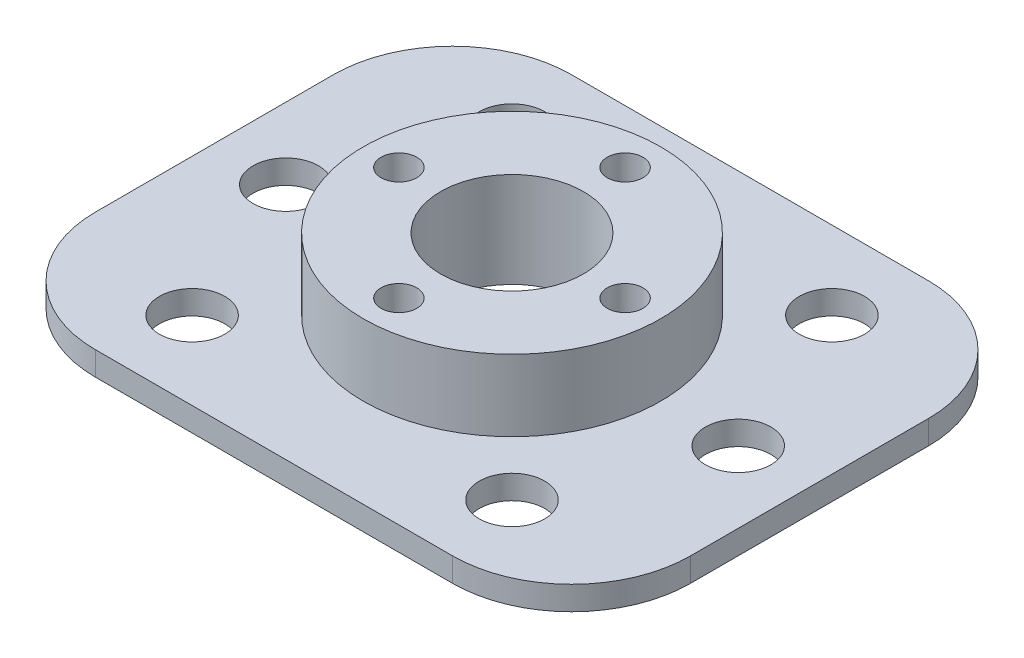
ISO-10303-21;
HEADER;
FILE_DESCRIPTION(('STEP AP214'),'2;1');
FILE_NAME('part.step','',(''),(''),'','','');
FILE_SCHEMA(('AUTOMOTIVE_DESIGN { 1 0 10303 214 1 1 1 1 }'));
ENDSEC;
DATA;
#1=APPLICATION_CONTEXT('core data for automotive mechanical design processes');
#2=APPLICATION_PROTOCOL_DEFINITION('international standard','automotive_design',2000,#1);
#3=PRODUCT_CONTEXT('',#1,'mechanical');
#4=PRODUCT('Part','Part','',(#3));
#5=PRODUCT_RELATED_PRODUCT_CATEGORY('part','',(#4));
#6=PRODUCT_DEFINITION_FORMATION('','',#4);
#7=PRODUCT_DEFINITION_CONTEXT('part definition',#1,'design');
#8=PRODUCT_DEFINITION('design','',#6,#7);
#9=PRODUCT_DEFINITION_SHAPE('','',#8);
#10=(LENGTH_UNIT() NAMED_UNIT(*) SI_UNIT(.MILLI.,.METRE.));
#11=(NAMED_UNIT(*) PLANE_ANGLE_UNIT() SI_UNIT($,.RADIAN.));
#12=(NAMED_UNIT(*) SI_UNIT($,.STERADIAN.) SOLID_ANGLE_UNIT());
#13=UNCERTAINTY_MEASURE_WITH_UNIT(LENGTH_MEASURE(1.E-05),#10,'distance_accuracy_value','');
#14=(GEOMETRIC_REPRESENTATION_CONTEXT(3) GLOBAL_UNCERTAINTY_ASSIGNED_CONTEXT((#13)) GLOBAL_UNIT_ASSIGNED_CONTEXT((#10,
#11,#12)) REPRESENTATION_CONTEXT('',''));
#15=CARTESIAN_POINT('',(0.,0.,0.));
#16=DIRECTION('',(0.,0.,1.));
#17=DIRECTION('',(1.,0.,0.));
#18=AXIS2_PLACEMENT_3D('',#15,#16,#17);
#19=CARTESIAN_POINT('',(25.,2.,0.));
#20=DIRECTION('',(1.,0.,0.));
#21=DIRECTION('',(0.,0.,-1.));
#22=AXIS2_PLACEMENT_3D('',#19,#20,#21);
#23=PLANE('',#22);
#24=DIRECTION('',(0.,0.,1.));
#25=VECTOR('',#24,1.);
#26=CARTESIAN_POINT('',(25.,0.,0.));
#27=LINE('',#26,#25);
#28=CARTESIAN_POINT('',(25.,0.,-10.));
#29=VERTEX_POINT('',#28);
#30=CARTESIAN_POINT('',(25.,0.,10.));
#31=VERTEX_POINT('',#30);
#32=EDGE_CURVE('E128',#29,#31,#27,.T.);
#33=ORIENTED_EDGE('',*,*,#32,.F.);
#34=DIRECTION('',(0.,-1.,0.));
#35=VECTOR('',#34,1.);
#36=CARTESIAN_POINT('',(25.,2.,-10.));
#37=LINE('',#36,#35);
#38=CARTESIAN_POINT('',(25.,2.,-10.));
#39=VERTEX_POINT('',#38);
#40=EDGE_CURVE('E156',#29,#39,#37,.F.);
#41=ORIENTED_EDGE('',*,*,#40,.T.);
#42=DIRECTION('',(0.,0.,1.));
#43=VECTOR('',#42,1.);
#44=CARTESIAN_POINT('',(25.,2.,0.));
#45=LINE('',#44,#43);
#46=CARTESIAN_POINT('',(25.,2.,10.));
#47=VERTEX_POINT('',#46);
#48=EDGE_CURVE('E183',#39,#47,#45,.T.);
#49=ORIENTED_EDGE('',*,*,#48,.T.);
#50=DIRECTION('',(0.,-1.,0.));
#51=VECTOR('',#50,1.);
#52=CARTESIAN_POINT('',(25.,0.,10.));
#53=LINE('',#52,#51);
#54=EDGE_CURVE('E152',#47,#31,#53,.T.);
#55=ORIENTED_EDGE('',*,*,#54,.T.);
#56=EDGE_LOOP('',(#33,#41,#49,#55));
#57=FACE_BOUND('',#56,.T.);
#58=ADVANCED_FACE('F38',(#57),#23,.T.);
#59=CARTESIAN_POINT('',(0.,2.,-20.));
#60=DIRECTION('',(0.,0.,-1.));
#61=DIRECTION('',(-1.,0.,0.));
#62=AXIS2_PLACEMENT_3D('',#59,#60,#61);
#63=PLANE('',#62);
#64=DIRECTION('',(1.,0.,0.));
#65=VECTOR('',#64,1.);
#66=CARTESIAN_POINT('',(0.,2.,-20.));
#67=LINE('',#66,#65);
#68=CARTESIAN_POINT('',(-15.,2.,-20.));
#69=VERTEX_POINT('',#68);
#70=CARTESIAN_POINT('',(15.,2.,-20.));
#71=VERTEX_POINT('',#70);
#72=EDGE_CURVE('E180',#69,#71,#67,.T.);
#73=ORIENTED_EDGE('',*,*,#72,.T.);
#74=DIRECTION('',(0.,-1.,0.));
#75=VECTOR('',#74,1.);
#76=CARTESIAN_POINT('',(15.,2.,-20.));
#77=LINE('',#76,#75);
#78=CARTESIAN_POINT('',(15.,0.,-20.));
#79=VERTEX_POINT('',#78);
#80=EDGE_CURVE('E118',#71,#79,#77,.T.);
#81=ORIENTED_EDGE('',*,*,#80,.T.);
#82=DIRECTION('',(1.,0.,0.));
#83=VECTOR('',#82,1.);
#84=CARTESIAN_POINT('',(0.,0.,-20.));
#85=LINE('',#84,#83);
#86=CARTESIAN_POINT('',(-15.,0.,-20.));
#87=VERTEX_POINT('',#86);
#88=EDGE_CURVE('E109',#87,#79,#85,.T.);
#89=ORIENTED_EDGE('',*,*,#88,.F.);
#90=DIRECTION('',(0.,-1.,0.));
#91=VECTOR('',#90,1.);
#92=CARTESIAN_POINT('',(-15.,2.,-20.));
#93=LINE('',#92,#91);
#94=EDGE_CURVE('E124',#87,#69,#93,.F.);
#95=ORIENTED_EDGE('',*,*,#94,.T.);
#96=EDGE_LOOP('',(#73,#81,#89,#95));
#97=FACE_BOUND('',#96,.T.);
#98=ADVANCED_FACE('F123',(#97),#63,.T.);
#99=CARTESIAN_POINT('',(-25.,2.,0.));
#100=DIRECTION('',(1.,0.,0.));
#101=DIRECTION('',(0.,0.,-1.));
#102=AXIS2_PLACEMENT_3D('',#99,#100,#101);
#103=PLANE('',#102);
#104=DIRECTION('',(0.,0.,1.));
#105=VECTOR('',#104,1.);
#106=CARTESIAN_POINT('',(-25.,0.,0.));
#107=LINE('',#106,#105);
#108=CARTESIAN_POINT('',(-25.,0.,-10.));
#109=VERTEX_POINT('',#108);
#110=CARTESIAN_POINT('',(-25.,0.,10.));
#111=VERTEX_POINT('',#110);
#112=EDGE_CURVE('E111',#109,#111,#107,.T.);
#113=ORIENTED_EDGE('',*,*,#112,.T.);
#114=DIRECTION('',(0.,-1.,0.));
#115=VECTOR('',#114,1.);
#116=CARTESIAN_POINT('',(-25.,2.,10.));
#117=LINE('',#116,#115);
#118=CARTESIAN_POINT('',(-25.,2.,10.));
#119=VERTEX_POINT('',#118);
#120=EDGE_CURVE('E11',#111,#119,#117,.F.);
#121=ORIENTED_EDGE('',*,*,#120,.T.);
#122=DIRECTION('',(0.,0.,1.));
#123=VECTOR('',#122,1.);
#124=CARTESIAN_POINT('',(-25.,2.,0.));
#125=LINE('',#124,#123);
#126=CARTESIAN_POINT('',(-25.,2.,-10.));
#127=VERTEX_POINT('',#126);
#128=EDGE_CURVE('E138',#127,#119,#125,.T.);
#129=ORIENTED_EDGE('',*,*,#128,.F.);
#130=DIRECTION('',(0.,-1.,0.));
#131=VECTOR('',#130,1.);
#132=CARTESIAN_POINT('',(-25.,0.,-10.));
#133=LINE('',#132,#131);
#134=EDGE_CURVE('E47',#127,#109,#133,.T.);
#135=ORIENTED_EDGE('',*,*,#134,.T.);
#136=EDGE_LOOP('',(#113,#121,#129,#135));
#137=FACE_BOUND('',#136,.T.);
#138=ADVANCED_FACE('F177',(#137),#103,.F.);
#139=CARTESIAN_POINT('',(0.,2.,20.));
#140=DIRECTION('',(0.,0.,-1.));
#141=DIRECTION('',(-1.,0.,0.));
#142=AXIS2_PLACEMENT_3D('',#139,#140,#141);
#143=PLANE('',#142);
#144=DIRECTION('',(1.,0.,0.));
#145=VECTOR('',#144,1.);
#146=CARTESIAN_POINT('',(0.,2.,20.));
#147=LINE('',#146,#145);
#148=CARTESIAN_POINT('',(-15.,2.,20.));
#149=VERTEX_POINT('',#148);
#150=CARTESIAN_POINT('',(15.,2.,20.));
#151=VERTEX_POINT('',#150);
#152=EDGE_CURVE('E133',#149,#151,#147,.T.);
#153=ORIENTED_EDGE('',*,*,#152,.F.);
#154=DIRECTION('',(0.,-1.,0.));
#155=VECTOR('',#154,1.);
#156=CARTESIAN_POINT('',(-15.,2.,20.));
#157=LINE('',#156,#155);
#158=CARTESIAN_POINT('',(-15.,0.,20.));
#159=VERTEX_POINT('',#158);
#160=EDGE_CURVE('E171',#149,#159,#157,.T.);
#161=ORIENTED_EDGE('',*,*,#160,.T.);
#162=DIRECTION('',(1.,0.,0.));
#163=VECTOR('',#162,1.);
#164=CARTESIAN_POINT('',(0.,0.,20.));
#165=LINE('',#164,#163);
#166=CARTESIAN_POINT('',(15.,0.,20.));
#167=VERTEX_POINT('',#166);
#168=EDGE_CURVE('E216',#159,#167,#165,.T.);
#169=ORIENTED_EDGE('',*,*,#168,.T.);
#170=DIRECTION('',(0.,-1.,0.));
#171=VECTOR('',#170,1.);
#172=CARTESIAN_POINT('',(15.,2.,20.));
#173=LINE('',#172,#171);
#174=EDGE_CURVE('E54',#167,#151,#173,.F.);
#175=ORIENTED_EDGE('',*,*,#174,.T.);
#176=EDGE_LOOP('',(#153,#161,#169,#175));
#177=FACE_BOUND('',#176,.T.);
#178=ADVANCED_FACE('F295',(#177),#143,.F.);
#179=CARTESIAN_POINT('',(13.4350288425443,2.,13.4350288425445));
#180=DIRECTION('',(0.,-1.,0.));
#181=DIRECTION('',(0.,0.,-1.));
#182=AXIS2_PLACEMENT_3D('',#179,#180,#181);
#183=CYLINDRICAL_SURFACE('',#182,2.74999999999997);
#184=CARTESIAN_POINT('',(13.4350288425443,2.,13.4350288425445));
#185=DIRECTION('',(0.,1.,0.));
#186=DIRECTION('',(0.,0.,1.));
#187=AXIS2_PLACEMENT_3D('',#184,#185,#186);
#188=CIRCLE('',#187,2.74999999999997);
#189=CARTESIAN_POINT('',(13.4350288425443,2.,16.1850288425445));
#190=VERTEX_POINT('',#189);
#191=EDGE_CURVE('E247',#190,#190,#188,.T.);
#192=ORIENTED_EDGE('',*,*,#191,.T.);
#193=EDGE_LOOP('',(#192));
#194=FACE_BOUND('',#193,.T.);
#195=CARTESIAN_POINT('',(13.4350288425443,0.,13.4350288425445));
#196=DIRECTION('',(0.,1.,0.));
#197=DIRECTION('',(0.,0.,1.));
#198=AXIS2_PLACEMENT_3D('',#195,#196,#197);
#199=CIRCLE('',#198,2.74999999999997);
#200=CARTESIAN_POINT('',(13.4350288425443,0.,16.1850288425445));
#201=VERTEX_POINT('',#200);
#202=EDGE_CURVE('E208',#201,#201,#199,.T.);
#203=ORIENTED_EDGE('',*,*,#202,.F.);
#204=EDGE_LOOP('',(#203));
#205=FACE_BOUND('',#204,.T.);
#206=ADVANCED_FACE('F291',(#194,#205),#183,.F.);
#207=CARTESIAN_POINT('',(19.0000000000001,2.,0.));
#208=DIRECTION('',(0.,-1.,0.));
#209=DIRECTION('',(0.,0.,-1.));
#210=AXIS2_PLACEMENT_3D('',#207,#208,#209);
#211=CYLINDRICAL_SURFACE('',#210,2.75000000000015);
#212=CARTESIAN_POINT('',(19.0000000000001,2.,0.));
#213=DIRECTION('',(0.,1.,0.));
#214=DIRECTION('',(0.,0.,1.));
#215=AXIS2_PLACEMENT_3D('',#212,#213,#214);
#216=CIRCLE('',#215,2.75000000000015);
#217=CARTESIAN_POINT('',(19.0000000000001,2.,2.75000000000015));
#218=VERTEX_POINT('',#217);
#219=EDGE_CURVE('E243',#218,#218,#216,.T.);
#220=ORIENTED_EDGE('',*,*,#219,.T.);
#221=EDGE_LOOP('',(#220));
#222=FACE_BOUND('',#221,.T.);
#223=CARTESIAN_POINT('',(19.0000000000001,0.,0.));
#224=DIRECTION('',(0.,1.,0.));
#225=DIRECTION('',(0.,0.,1.));
#226=AXIS2_PLACEMENT_3D('',#223,#224,#225);
#227=CIRCLE('',#226,2.75000000000015);
#228=CARTESIAN_POINT('',(19.0000000000001,0.,2.75000000000015));
#229=VERTEX_POINT('',#228);
#230=EDGE_CURVE('E204',#229,#229,#227,.T.);
#231=ORIENTED_EDGE('',*,*,#230,.F.);
#232=EDGE_LOOP('',(#231));
#233=FACE_BOUND('',#232,.T.);
#234=ADVANCED_FACE('F294',(#222,#233),#211,.F.);
#235=CARTESIAN_POINT('',(13.4350288425443,2.,-13.4350288425444));
#236=DIRECTION('',(0.,-1.,0.));
#237=DIRECTION('',(0.,0.,-1.));
#238=AXIS2_PLACEMENT_3D('',#235,#236,#237);
#239=CYLINDRICAL_SURFACE('',#238,2.75);
#240=CARTESIAN_POINT('',(13.4350288425443,2.,-13.4350288425444));
#241=DIRECTION('',(0.,1.,0.));
#242=DIRECTION('',(0.,0.,1.));
#243=AXIS2_PLACEMENT_3D('',#240,#241,#242);
#244=CIRCLE('',#243,2.75);
#245=CARTESIAN_POINT('',(13.4350288425443,2.,-10.6850288425444));
#246=VERTEX_POINT('',#245);
#247=EDGE_CURVE('E239',#246,#246,#244,.T.);
#248=ORIENTED_EDGE('',*,*,#247,.T.);
#249=EDGE_LOOP('',(#248));
#250=FACE_BOUND('',#249,.T.);
#251=CARTESIAN_POINT('',(13.4350288425443,0.,-13.4350288425444));
#252=DIRECTION('',(0.,1.,0.));
#253=DIRECTION('',(0.,0.,1.));
#254=AXIS2_PLACEMENT_3D('',#251,#252,#253);
#255=CIRCLE('',#254,2.75);
#256=CARTESIAN_POINT('',(13.4350288425443,0.,-10.6850288425444));
#257=VERTEX_POINT('',#256);
#258=EDGE_CURVE('E200',#257,#257,#255,.T.);
#259=ORIENTED_EDGE('',*,*,#258,.F.);
#260=EDGE_LOOP('',(#259));
#261=FACE_BOUND('',#260,.T.);
#262=ADVANCED_FACE('F299',(#250,#261),#239,.F.);
#263=CARTESIAN_POINT('',(-13.4350288425445,2.,-13.4350288425444));
#264=DIRECTION('',(0.,-1.,0.));
#265=DIRECTION('',(0.,0.,-1.));
#266=AXIS2_PLACEMENT_3D('',#263,#264,#265);
#267=CYLINDRICAL_SURFACE('',#266,2.75);
#268=CARTESIAN_POINT('',(-13.4350288425445,2.,-13.4350288425444));
#269=DIRECTION('',(0.,1.,0.));
#270=DIRECTION('',(0.,0.,1.));
#271=AXIS2_PLACEMENT_3D('',#268,#269,#270);
#272=CIRCLE('',#271,2.75);
#273=CARTESIAN_POINT('',(-13.4350288425445,2.,-10.6850288425444));
#274=VERTEX_POINT('',#273);
#275=EDGE_CURVE('E231',#274,#274,#272,.T.);
#276=ORIENTED_EDGE('',*,*,#275,.T.);
#277=EDGE_LOOP('',(#276));
#278=FACE_BOUND('',#277,.T.);
#279=CARTESIAN_POINT('',(-13.4350288425445,0.,-13.4350288425444));
#280=DIRECTION('',(0.,1.,0.));
#281=DIRECTION('',(0.,0.,1.));
#282=AXIS2_PLACEMENT_3D('',#279,#280,#281);
#283=CIRCLE('',#282,2.75);
#284=CARTESIAN_POINT('',(-13.4350288425445,0.,-10.6850288425444));
#285=VERTEX_POINT('',#284);
#286=EDGE_CURVE('E196',#285,#285,#283,.T.);
#287=ORIENTED_EDGE('',*,*,#286,.F.);
#288=EDGE_LOOP('',(#287));
#289=FACE_BOUND('',#288,.T.);
#290=ADVANCED_FACE('F303',(#278,#289),#267,.F.);
#291=CARTESIAN_POINT('',(-19.0000000000001,2.,0.));
#292=DIRECTION('',(0.,-1.,0.));
#293=DIRECTION('',(0.,0.,-1.));
#294=AXIS2_PLACEMENT_3D('',#291,#292,#293);
#295=CYLINDRICAL_SURFACE('',#294,2.75000000000002);
#296=CARTESIAN_POINT('',(-19.0000000000001,2.,0.));
#297=DIRECTION('',(0.,1.,0.));
#298=DIRECTION('',(0.,0.,1.));
#299=AXIS2_PLACEMENT_3D('',#296,#297,#298);
#300=CIRCLE('',#299,2.75000000000002);
#301=CARTESIAN_POINT('',(-19.0000000000001,2.,2.75000000000002));
#302=VERTEX_POINT('',#301);
#303=EDGE_CURVE('E225',#302,#302,#300,.T.);
#304=ORIENTED_EDGE('',*,*,#303,.T.);
#305=EDGE_LOOP('',(#304));
#306=FACE_BOUND('',#305,.T.);
#307=CARTESIAN_POINT('',(-19.0000000000001,0.,0.));
#308=DIRECTION('',(0.,1.,0.));
#309=DIRECTION('',(0.,0.,1.));
#310=AXIS2_PLACEMENT_3D('',#307,#308,#309);
#311=CIRCLE('',#310,2.75000000000002);
#312=CARTESIAN_POINT('',(-19.0000000000001,0.,2.75000000000002));
#313=VERTEX_POINT('',#312);
#314=EDGE_CURVE('E191',#313,#313,#311,.T.);
#315=ORIENTED_EDGE('',*,*,#314,.F.);
#316=EDGE_LOOP('',(#315));
#317=FACE_BOUND('',#316,.T.);
#318=ADVANCED_FACE('F307',(#306,#317),#295,.F.);
#319=CARTESIAN_POINT('',(-13.4350288425445,2.,13.4350288425445));
#320=DIRECTION('',(0.,-1.,0.));
#321=DIRECTION('',(0.,0.,-1.));
#322=AXIS2_PLACEMENT_3D('',#319,#320,#321);
#323=CYLINDRICAL_SURFACE('',#322,2.74999999999999);
#324=CARTESIAN_POINT('',(-13.4350288425445,2.,13.4350288425445));
#325=DIRECTION('',(0.,1.,0.));
#326=DIRECTION('',(0.,0.,1.));
#327=AXIS2_PLACEMENT_3D('',#324,#325,#326);
#328=CIRCLE('',#327,2.74999999999999);
#329=CARTESIAN_POINT('',(-13.4350288425445,2.,16.1850288425445));
#330=VERTEX_POINT('',#329);
#331=EDGE_CURVE('E221',#330,#330,#328,.T.);
#332=ORIENTED_EDGE('',*,*,#331,.T.);
#333=EDGE_LOOP('',(#332));
#334=FACE_BOUND('',#333,.T.);
#335=CARTESIAN_POINT('',(-13.4350288425445,0.,13.4350288425445));
#336=DIRECTION('',(0.,1.,0.));
#337=DIRECTION('',(0.,0.,1.));
#338=AXIS2_PLACEMENT_3D('',#335,#336,#337);
#339=CIRCLE('',#338,2.74999999999999);
#340=CARTESIAN_POINT('',(-13.4350288425445,0.,16.1850288425445));
#341=VERTEX_POINT('',#340);
#342=EDGE_CURVE('E187',#341,#341,#339,.T.);
#343=ORIENTED_EDGE('',*,*,#342,.F.);
#344=EDGE_LOOP('',(#343));
#345=FACE_BOUND('',#344,.T.);
#346=ADVANCED_FACE('F276',(#334,#345),#323,.F.);
#347=CARTESIAN_POINT('',(0.,2.,0.));
#348=DIRECTION('',(0.,-1.,0.));
#349=DIRECTION('',(0.,0.,-1.));
#350=AXIS2_PLACEMENT_3D('',#347,#348,#349);
#351=CYLINDRICAL_SURFACE('',#350,6.);
#352=CARTESIAN_POINT('',(0.,0.,0.));
#353=DIRECTION('',(0.,1.,0.));
#354=DIRECTION('',(0.,0.,1.));
#355=AXIS2_PLACEMENT_3D('',#352,#353,#354);
#356=CIRCLE('',#355,6.);
#357=CARTESIAN_POINT('',(0.,0.,6.));
#358=VERTEX_POINT('',#357);
#359=EDGE_CURVE('E141',#358,#358,#356,.T.);
#360=ORIENTED_EDGE('',*,*,#359,.F.);
#361=EDGE_LOOP('',(#360));
#362=FACE_BOUND('',#361,.T.);
#363=CARTESIAN_POINT('',(0.,8.,0.));
#364=DIRECTION('',(0.,1.,0.));
#365=DIRECTION('',(0.,0.,1.));
#366=AXIS2_PLACEMENT_3D('',#363,#364,#365);
#367=CIRCLE('',#366,6.);
#368=CARTESIAN_POINT('',(0.,8.,6.));
#369=VERTEX_POINT('',#368);
#370=EDGE_CURVE('E524',#369,#369,#367,.T.);
#371=ORIENTED_EDGE('',*,*,#370,.T.);
#372=EDGE_LOOP('',(#371));
#373=FACE_BOUND('',#372,.T.);
#374=ADVANCED_FACE('F265',(#362,#373),#351,.F.);
#375=CARTESIAN_POINT('',(0.,2.,0.));
#376=DIRECTION('',(0.,1.,0.));
#377=DIRECTION('',(0.,0.,1.));
#378=AXIS2_PLACEMENT_3D('',#375,#376,#377);
#379=PLANE('',#378);
#380=CARTESIAN_POINT('',(0.,2.,0.));
#381=DIRECTION('',(0.,1.,0.));
#382=DIRECTION('',(0.,0.,1.));
#383=AXIS2_PLACEMENT_3D('',#380,#381,#382);
#384=CIRCLE('',#383,12.5);
#385=CARTESIAN_POINT('',(0.,2.,12.5));
#386=VERTEX_POINT('',#385);
#387=EDGE_CURVE('E192',#386,#386,#384,.F.);
#388=ORIENTED_EDGE('',*,*,#387,.T.);
#389=EDGE_LOOP('',(#388));
#390=FACE_BOUND('',#389,.T.);
#391=ORIENTED_EDGE('',*,*,#331,.F.);
#392=EDGE_LOOP('',(#391));
#393=FACE_BOUND('',#392,.T.);
#394=ORIENTED_EDGE('',*,*,#303,.F.);
#395=EDGE_LOOP('',(#394));
#396=FACE_BOUND('',#395,.T.);
#397=ORIENTED_EDGE('',*,*,#275,.F.);
#398=EDGE_LOOP('',(#397));
#399=FACE_BOUND('',#398,.T.);
#400=ORIENTED_EDGE('',*,*,#247,.F.);
#401=EDGE_LOOP('',(#400));
#402=FACE_BOUND('',#401,.T.);
#403=ORIENTED_EDGE('',*,*,#219,.F.);
#404=EDGE_LOOP('',(#403));
#405=FACE_BOUND('',#404,.T.);
#406=ORIENTED_EDGE('',*,*,#191,.F.);
#407=EDGE_LOOP('',(#406));
#408=FACE_BOUND('',#407,.T.);
#409=ORIENTED_EDGE('',*,*,#48,.F.);
#410=CARTESIAN_POINT('',(15.,2.,-10.));
#411=DIRECTION('',(0.,1.,0.));
#412=DIRECTION('',(0.,0.,1.));
#413=AXIS2_PLACEMENT_3D('',#410,#411,#412);
#414=CIRCLE('',#413,10.);
#415=EDGE_CURVE('E166',#39,#71,#414,.T.);
#416=ORIENTED_EDGE('',*,*,#415,.T.);
#417=ORIENTED_EDGE('',*,*,#72,.F.);
#418=CARTESIAN_POINT('',(-15.,2.,-10.));
#419=DIRECTION('',(0.,1.,0.));
#420=DIRECTION('',(0.,0.,1.));
#421=AXIS2_PLACEMENT_3D('',#418,#419,#420);
#422=CIRCLE('',#421,10.);
#423=EDGE_CURVE('E131',#69,#127,#422,.T.);
#424=ORIENTED_EDGE('',*,*,#423,.T.);
#425=ORIENTED_EDGE('',*,*,#128,.T.);
#426=CARTESIAN_POINT('',(-15.,2.,10.));
#427=DIRECTION('',(0.,1.,0.));
#428=DIRECTION('',(0.,0.,1.));
#429=AXIS2_PLACEMENT_3D('',#426,#427,#428);
#430=CIRCLE('',#429,10.);
#431=EDGE_CURVE('E61',#119,#149,#430,.T.);
#432=ORIENTED_EDGE('',*,*,#431,.T.);
#433=ORIENTED_EDGE('',*,*,#152,.T.);
#434=CARTESIAN_POINT('',(15.,2.,10.));
#435=DIRECTION('',(0.,1.,0.));
#436=DIRECTION('',(0.,0.,1.));
#437=AXIS2_PLACEMENT_3D('',#434,#435,#436);
#438=CIRCLE('',#437,10.);
#439=EDGE_CURVE('E161',#151,#47,#438,.T.);
#440=ORIENTED_EDGE('',*,*,#439,.T.);
#441=EDGE_LOOP('',(#409,#416,#417,#424,#425,#432,#433,#440));
#442=FACE_BOUND('',#441,.T.);
#443=ADVANCED_FACE('F263',(#390,#393,#396,#399,#402,#405,#408,#442),#379,.T.);
#444=CARTESIAN_POINT('',(0.,0.,0.));
#445=DIRECTION('',(0.,1.,0.));
#446=DIRECTION('',(0.,0.,1.));
#447=AXIS2_PLACEMENT_3D('',#444,#445,#446);
#448=PLANE('',#447);
#449=CARTESIAN_POINT('',(9.5,0.,0.));
#450=DIRECTION('',(0.,1.,0.));
#451=DIRECTION('',(0.,0.,1.));
#452=AXIS2_PLACEMENT_3D('',#449,#450,#451);
#453=CIRCLE('',#452,1.50000000000001);
#454=CARTESIAN_POINT('',(9.5,0.,1.50000000000011));
#455=VERTEX_POINT('',#454);
#456=EDGE_CURVE('E491',#455,#455,#453,.T.);
#457=ORIENTED_EDGE('',*,*,#456,.T.);
#458=EDGE_LOOP('',(#457));
#459=FACE_BOUND('',#458,.T.);
#460=CARTESIAN_POINT('',(0.,0.,-9.5));
#461=DIRECTION('',(0.,1.,0.));
#462=DIRECTION('',(0.,0.,1.));
#463=AXIS2_PLACEMENT_3D('',#460,#461,#462);
#464=CIRCLE('',#463,1.50000000000001);
#465=CARTESIAN_POINT('',(0.,0.,-7.99999999999999));
#466=VERTEX_POINT('',#465);
#467=EDGE_CURVE('E504',#466,#466,#464,.T.);
#468=ORIENTED_EDGE('',*,*,#467,.T.);
#469=EDGE_LOOP('',(#468));
#470=FACE_BOUND('',#469,.T.);
#471=CARTESIAN_POINT('',(-9.5,0.,0.));
#472=DIRECTION('',(0.,1.,0.));
#473=DIRECTION('',(0.,0.,1.));
#474=AXIS2_PLACEMENT_3D('',#471,#472,#473);
#475=CIRCLE('',#474,1.50000000000001);
#476=CARTESIAN_POINT('',(-9.5,0.,1.49999999999998));
#477=VERTEX_POINT('',#476);
#478=EDGE_CURVE('E512',#477,#477,#475,.T.);
#479=ORIENTED_EDGE('',*,*,#478,.T.);
#480=EDGE_LOOP('',(#479));
#481=FACE_BOUND('',#480,.T.);
#482=CARTESIAN_POINT('',(0.,0.,9.5));
#483=DIRECTION('',(0.,1.,0.));
#484=DIRECTION('',(0.,0.,1.));
#485=AXIS2_PLACEMENT_3D('',#482,#483,#484);
#486=CIRCLE('',#485,1.50000000000001);
#487=CARTESIAN_POINT('',(0.,0.,11.));
#488=VERTEX_POINT('',#487);
#489=EDGE_CURVE('E520',#488,#488,#486,.T.);
#490=ORIENTED_EDGE('',*,*,#489,.T.);
#491=EDGE_LOOP('',(#490));
#492=FACE_BOUND('',#491,.T.);
#493=ORIENTED_EDGE('',*,*,#342,.T.);
#494=EDGE_LOOP('',(#493));
#495=FACE_BOUND('',#494,.T.);
#496=ORIENTED_EDGE('',*,*,#314,.T.);
#497=EDGE_LOOP('',(#496));
#498=FACE_BOUND('',#497,.T.);
#499=ORIENTED_EDGE('',*,*,#286,.T.);
#500=EDGE_LOOP('',(#499));
#501=FACE_BOUND('',#500,.T.);
#502=ORIENTED_EDGE('',*,*,#258,.T.);
#503=EDGE_LOOP('',(#502));
#504=FACE_BOUND('',#503,.T.);
#505=ORIENTED_EDGE('',*,*,#230,.T.);
#506=EDGE_LOOP('',(#505));
#507=FACE_BOUND('',#506,.T.);
#508=ORIENTED_EDGE('',*,*,#202,.T.);
#509=EDGE_LOOP('',(#508));
#510=FACE_BOUND('',#509,.T.);
#511=ORIENTED_EDGE('',*,*,#88,.T.);
#512=CARTESIAN_POINT('',(15.,0.,-10.));
#513=DIRECTION('',(0.,1.,0.));
#514=DIRECTION('',(0.,0.,1.));
#515=AXIS2_PLACEMENT_3D('',#512,#513,#514);
#516=CIRCLE('',#515,10.);
#517=EDGE_CURVE('E149',#79,#29,#516,.F.);
#518=ORIENTED_EDGE('',*,*,#517,.T.);
#519=ORIENTED_EDGE('',*,*,#32,.T.);
#520=CARTESIAN_POINT('',(15.,0.,10.));
#521=DIRECTION('',(0.,1.,0.));
#522=DIRECTION('',(0.,0.,1.));
#523=AXIS2_PLACEMENT_3D('',#520,#521,#522);
#524=CIRCLE('',#523,10.);
#525=EDGE_CURVE('E117',#31,#167,#524,.F.);
#526=ORIENTED_EDGE('',*,*,#525,.T.);
#527=ORIENTED_EDGE('',*,*,#168,.F.);
#528=CARTESIAN_POINT('',(-15.,0.,10.));
#529=DIRECTION('',(0.,1.,0.));
#530=DIRECTION('',(0.,0.,1.));
#531=AXIS2_PLACEMENT_3D('',#528,#529,#530);
#532=CIRCLE('',#531,10.);
#533=EDGE_CURVE('E146',#159,#111,#532,.F.);
#534=ORIENTED_EDGE('',*,*,#533,.T.);
#535=ORIENTED_EDGE('',*,*,#112,.F.);
#536=CARTESIAN_POINT('',(-15.,0.,-10.));
#537=DIRECTION('',(0.,1.,0.));
#538=DIRECTION('',(0.,0.,1.));
#539=AXIS2_PLACEMENT_3D('',#536,#537,#538);
#540=CIRCLE('',#539,10.);
#541=EDGE_CURVE('E105',#109,#87,#540,.F.);
#542=ORIENTED_EDGE('',*,*,#541,.T.);
#543=EDGE_LOOP('',(#511,#518,#519,#526,#527,#534,#535,#542));
#544=FACE_BOUND('',#543,.T.);
#545=ORIENTED_EDGE('',*,*,#359,.T.);
#546=EDGE_LOOP('',(#545));
#547=FACE_BOUND('',#546,.T.);
#548=ADVANCED_FACE('F107',(#459,#470,#481,#492,#495,#498,#501,#504,#507,#510,#544,#547),#448,.F.);
#549=CARTESIAN_POINT('',(0.,8.,0.));
#550=DIRECTION('',(0.,-1.,0.));
#551=DIRECTION('',(0.,0.,-1.));
#552=AXIS2_PLACEMENT_3D('',#549,#550,#551);
#553=CYLINDRICAL_SURFACE('',#552,12.5);
#554=ORIENTED_EDGE('',*,*,#387,.F.);
#555=EDGE_LOOP('',(#554));
#556=FACE_BOUND('',#555,.T.);
#557=CARTESIAN_POINT('',(0.,8.,0.));
#558=DIRECTION('',(0.,1.,0.));
#559=DIRECTION('',(0.,0.,1.));
#560=AXIS2_PLACEMENT_3D('',#557,#558,#559);
#561=CIRCLE('',#560,12.5);
#562=CARTESIAN_POINT('',(0.,8.,12.5));
#563=VERTEX_POINT('',#562);
#564=EDGE_CURVE('E527',#563,#563,#561,.T.);
#565=ORIENTED_EDGE('',*,*,#564,.F.);
#566=EDGE_LOOP('',(#565));
#567=FACE_BOUND('',#566,.T.);
#568=ADVANCED_FACE('F272',(#556,#567),#553,.T.);
#569=CARTESIAN_POINT('',(0.,8.,0.));
#570=DIRECTION('',(0.,1.,0.));
#571=DIRECTION('',(0.,0.,1.));
#572=AXIS2_PLACEMENT_3D('',#569,#570,#571);
#573=PLANE('',#572);
#574=CARTESIAN_POINT('',(9.5,8.,0.));
#575=DIRECTION('',(0.,1.,0.));
#576=DIRECTION('',(0.,0.,1.));
#577=AXIS2_PLACEMENT_3D('',#574,#575,#576);
#578=CIRCLE('',#577,1.50000000000001);
#579=CARTESIAN_POINT('',(9.5,8.,1.50000000000011));
#580=VERTEX_POINT('',#579);
#581=EDGE_CURVE('E494',#580,#580,#578,.T.);
#582=ORIENTED_EDGE('',*,*,#581,.F.);
#583=EDGE_LOOP('',(#582));
#584=FACE_BOUND('',#583,.T.);
#585=CARTESIAN_POINT('',(0.,8.,-9.5));
#586=DIRECTION('',(0.,1.,0.));
#587=DIRECTION('',(0.,0.,1.));
#588=AXIS2_PLACEMENT_3D('',#585,#586,#587);
#589=CIRCLE('',#588,1.50000000000001);
#590=CARTESIAN_POINT('',(0.,8.,-7.99999999999999));
#591=VERTEX_POINT('',#590);
#592=EDGE_CURVE('E498',#591,#591,#589,.T.);
#593=ORIENTED_EDGE('',*,*,#592,.F.);
#594=EDGE_LOOP('',(#593));
#595=FACE_BOUND('',#594,.T.);
#596=CARTESIAN_POINT('',(-9.5,8.,0.));
#597=DIRECTION('',(0.,1.,0.));
#598=DIRECTION('',(0.,0.,1.));
#599=AXIS2_PLACEMENT_3D('',#596,#597,#598);
#600=CIRCLE('',#599,1.50000000000001);
#601=CARTESIAN_POINT('',(-9.5,8.,1.49999999999998));
#602=VERTEX_POINT('',#601);
#603=EDGE_CURVE('E508',#602,#602,#600,.T.);
#604=ORIENTED_EDGE('',*,*,#603,.F.);
#605=EDGE_LOOP('',(#604));
#606=FACE_BOUND('',#605,.T.);
#607=CARTESIAN_POINT('',(0.,8.,9.5));
#608=DIRECTION('',(0.,1.,0.));
#609=DIRECTION('',(0.,0.,1.));
#610=AXIS2_PLACEMENT_3D('',#607,#608,#609);
#611=CIRCLE('',#610,1.50000000000001);
#612=CARTESIAN_POINT('',(0.,8.,11.));
#613=VERTEX_POINT('',#612);
#614=EDGE_CURVE('E516',#613,#613,#611,.T.);
#615=ORIENTED_EDGE('',*,*,#614,.F.);
#616=EDGE_LOOP('',(#615));
#617=FACE_BOUND('',#616,.T.);
#618=ORIENTED_EDGE('',*,*,#370,.F.);
#619=EDGE_LOOP('',(#618));
#620=FACE_BOUND('',#619,.T.);
#621=ORIENTED_EDGE('',*,*,#564,.T.);
#622=EDGE_LOOP('',(#621));
#623=FACE_BOUND('',#622,.T.);
#624=ADVANCED_FACE('F362',(#584,#595,#606,#617,#620,#623),#573,.T.);
#625=CARTESIAN_POINT('',(0.,8.,9.5));
#626=DIRECTION('',(0.,1.,0.));
#627=DIRECTION('',(0.,0.,1.));
#628=AXIS2_PLACEMENT_3D('',#625,#626,#627);
#629=CYLINDRICAL_SURFACE('',#628,1.50000000000001);
#630=ORIENTED_EDGE('',*,*,#489,.F.);
#631=EDGE_LOOP('',(#630));
#632=FACE_BOUND('',#631,.T.);
#633=ORIENTED_EDGE('',*,*,#614,.T.);
#634=EDGE_LOOP('',(#633));
#635=FACE_BOUND('',#634,.T.);
#636=ADVANCED_FACE('F371',(#632,#635),#629,.F.);
#637=CARTESIAN_POINT('',(-9.5,8.,0.));
#638=DIRECTION('',(0.,1.,0.));
#639=DIRECTION('',(0.,0.,1.));
#640=AXIS2_PLACEMENT_3D('',#637,#638,#639);
#641=CYLINDRICAL_SURFACE('',#640,1.50000000000001);
#642=ORIENTED_EDGE('',*,*,#478,.F.);
#643=EDGE_LOOP('',(#642));
#644=FACE_BOUND('',#643,.T.);
#645=ORIENTED_EDGE('',*,*,#603,.T.);
#646=EDGE_LOOP('',(#645));
#647=FACE_BOUND('',#646,.T.);
#648=ADVANCED_FACE('F379',(#644,#647),#641,.F.);
#649=CARTESIAN_POINT('',(0.,8.,-9.5));
#650=DIRECTION('',(0.,1.,0.));
#651=DIRECTION('',(0.,0.,1.));
#652=AXIS2_PLACEMENT_3D('',#649,#650,#651);
#653=CYLINDRICAL_SURFACE('',#652,1.50000000000001);
#654=ORIENTED_EDGE('',*,*,#467,.F.);
#655=EDGE_LOOP('',(#654));
#656=FACE_BOUND('',#655,.T.);
#657=ORIENTED_EDGE('',*,*,#592,.T.);
#658=EDGE_LOOP('',(#657));
#659=FACE_BOUND('',#658,.T.);
#660=ADVANCED_FACE('F386',(#656,#659),#653,.F.);
#661=CARTESIAN_POINT('',(9.5,8.,0.));
#662=DIRECTION('',(0.,1.,0.));
#663=DIRECTION('',(0.,0.,1.));
#664=AXIS2_PLACEMENT_3D('',#661,#662,#663);
#665=CYLINDRICAL_SURFACE('',#664,1.50000000000001);
#666=ORIENTED_EDGE('',*,*,#456,.F.);
#667=EDGE_LOOP('',(#666));
#668=FACE_BOUND('',#667,.T.);
#669=ORIENTED_EDGE('',*,*,#581,.T.);
#670=EDGE_LOOP('',(#669));
#671=FACE_BOUND('',#670,.T.);
#672=ADVANCED_FACE('F317',(#668,#671),#665,.F.);
#673=CARTESIAN_POINT('',(15.,2.,-10.));
#674=DIRECTION('',(0.,-1.,0.));
#675=DIRECTION('',(0.,0.,-1.));
#676=AXIS2_PLACEMENT_3D('',#673,#674,#675);
#677=CYLINDRICAL_SURFACE('',#676,10.);
#678=ORIENTED_EDGE('',*,*,#415,.F.);
#679=ORIENTED_EDGE('',*,*,#40,.F.);
#680=ORIENTED_EDGE('',*,*,#517,.F.);
#681=ORIENTED_EDGE('',*,*,#80,.F.);
#682=EDGE_LOOP('',(#678,#679,#680,#681));
#683=FACE_BOUND('',#682,.T.);
#684=ADVANCED_FACE('F262',(#683),#677,.T.);
#685=CARTESIAN_POINT('',(-15.,2.,10.));
#686=DIRECTION('',(0.,-1.,0.));
#687=DIRECTION('',(0.,0.,-1.));
#688=AXIS2_PLACEMENT_3D('',#685,#686,#687);
#689=CYLINDRICAL_SURFACE('',#688,10.);
#690=ORIENTED_EDGE('',*,*,#431,.F.);
#691=ORIENTED_EDGE('',*,*,#120,.F.);
#692=ORIENTED_EDGE('',*,*,#533,.F.);
#693=ORIENTED_EDGE('',*,*,#160,.F.);
#694=EDGE_LOOP('',(#690,#691,#692,#693));
#695=FACE_BOUND('',#694,.T.);
#696=ADVANCED_FACE('F316',(#695),#689,.T.);
#697=CARTESIAN_POINT('',(15.,2.,10.));
#698=DIRECTION('',(0.,1.,0.));
#699=DIRECTION('',(0.,0.,1.));
#700=AXIS2_PLACEMENT_3D('',#697,#698,#699);
#701=CYLINDRICAL_SURFACE('',#700,10.);
#702=ORIENTED_EDGE('',*,*,#439,.F.);
#703=ORIENTED_EDGE('',*,*,#174,.F.);
#704=ORIENTED_EDGE('',*,*,#525,.F.);
#705=ORIENTED_EDGE('',*,*,#54,.F.);
#706=EDGE_LOOP('',(#702,#703,#704,#705));
#707=FACE_BOUND('',#706,.T.);
#708=ADVANCED_FACE('F260',(#707),#701,.T.);
#709=CARTESIAN_POINT('',(-15.,2.,-10.));
#710=DIRECTION('',(0.,1.,0.));
#711=DIRECTION('',(0.,0.,1.));
#712=AXIS2_PLACEMENT_3D('',#709,#710,#711);
#713=CYLINDRICAL_SURFACE('',#712,10.);
#714=ORIENTED_EDGE('',*,*,#423,.F.);
#715=ORIENTED_EDGE('',*,*,#94,.F.);
#716=ORIENTED_EDGE('',*,*,#541,.F.);
#717=ORIENTED_EDGE('',*,*,#134,.F.);
#718=EDGE_LOOP('',(#714,#715,#716,#717));
#719=FACE_BOUND('',#718,.T.);
#720=ADVANCED_FACE('F40',(#719),#713,.T.);
#721=CLOSED_SHELL('',(#58,#98,#138,#178,#206,#234,#262,#290,#318,#346,#374,#443,#548,#568,#624,
#636,#648,#660,#672,#684,#696,#708,#720));
#722=MANIFOLD_SOLID_BREP('B2',#721);
#723=ADVANCED_BREP_SHAPE_REPRESENTATION('',(#18,#722),#14);
#724=SHAPE_DEFINITION_REPRESENTATION(#9,#723);
ENDSEC;
END-ISO-10303-21;
